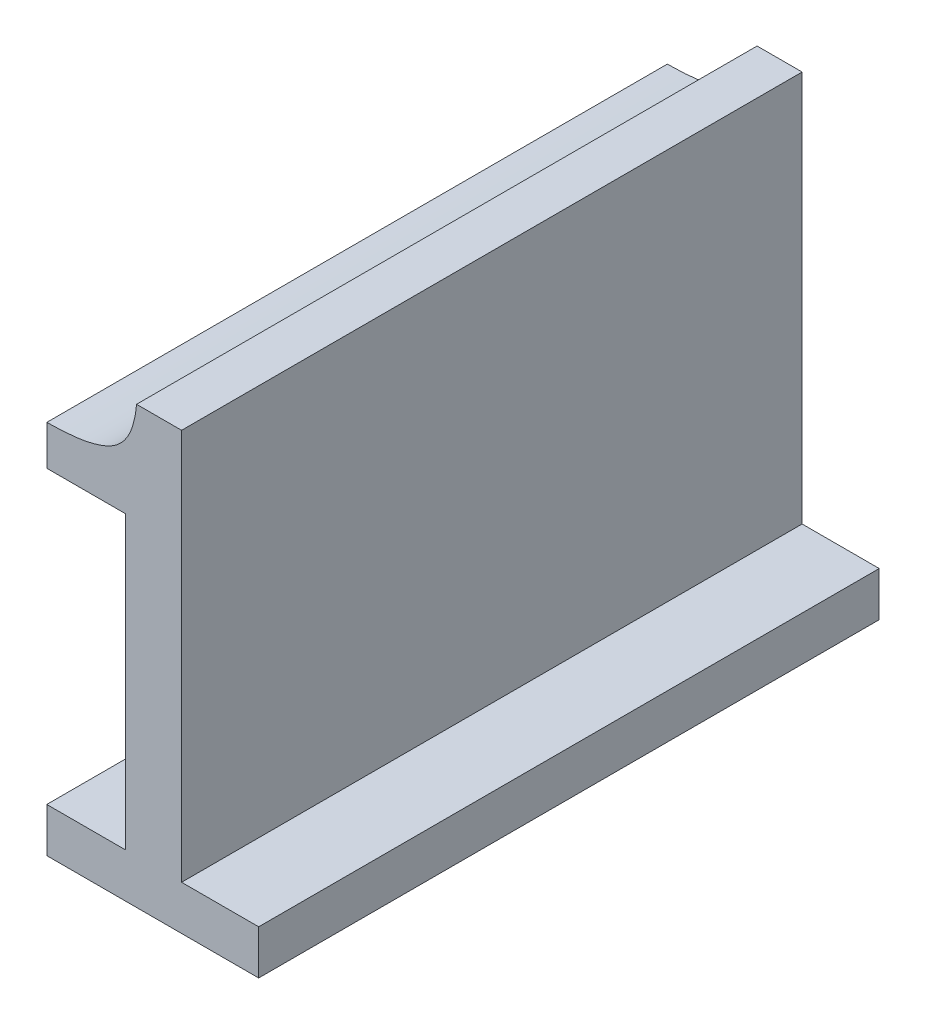
ISO-10303-21;
HEADER;
FILE_DESCRIPTION(('STEP AP214'),'2;1');
FILE_NAME('part.step','',(''),(''),'','','');
FILE_SCHEMA(('AUTOMOTIVE_DESIGN { 1 0 10303 214 1 1 1 1 }'));
ENDSEC;
DATA;
#1=APPLICATION_CONTEXT('core data for automotive mechanical design processes');
#2=APPLICATION_PROTOCOL_DEFINITION('international standard','automotive_design',2000,#1);
#3=PRODUCT_CONTEXT('',#1,'mechanical');
#4=PRODUCT('Part','Part','',(#3));
#5=PRODUCT_RELATED_PRODUCT_CATEGORY('part','',(#4));
#6=PRODUCT_DEFINITION_FORMATION('','',#4);
#7=PRODUCT_DEFINITION_CONTEXT('part definition',#1,'design');
#8=PRODUCT_DEFINITION('design','',#6,#7);
#9=PRODUCT_DEFINITION_SHAPE('','',#8);
#10=(LENGTH_UNIT() NAMED_UNIT(*) SI_UNIT(.MILLI.,.METRE.));
#11=(NAMED_UNIT(*) PLANE_ANGLE_UNIT() SI_UNIT($,.RADIAN.));
#12=(NAMED_UNIT(*) SI_UNIT($,.STERADIAN.) SOLID_ANGLE_UNIT());
#13=UNCERTAINTY_MEASURE_WITH_UNIT(LENGTH_MEASURE(1.E-05),#10,'distance_accuracy_value','');
#14=(GEOMETRIC_REPRESENTATION_CONTEXT(3) GLOBAL_UNCERTAINTY_ASSIGNED_CONTEXT((#13)) GLOBAL_UNIT_ASSIGNED_CONTEXT((#10,
#11,#12)) REPRESENTATION_CONTEXT('',''));
#15=CARTESIAN_POINT('',(0.,0.,0.));
#16=DIRECTION('',(0.,0.,1.));
#17=DIRECTION('',(1.,0.,0.));
#18=AXIS2_PLACEMENT_3D('',#15,#16,#17);
#19=CARTESIAN_POINT('',(0.788286562016744,-0.564767109594651,0.));
#20=DIRECTION('',(-1.,0.,0.));
#21=DIRECTION('',(0.,-1.,0.));
#22=AXIS2_PLACEMENT_3D('',#19,#20,#21);
#23=PLANE('',#22);
#24=DIRECTION('',(0.,1.,0.));
#25=VECTOR('',#24,1.);
#26=CARTESIAN_POINT('',(0.788286562016744,-0.571914597659679,0.));
#27=LINE('',#26,#25);
#28=CARTESIAN_POINT('',(0.788286562016744,-0.571914597659679,0.));
#29=VERTEX_POINT('',#28);
#30=CARTESIAN_POINT('',(0.788286562016744,-0.564767109594651,0.));
#31=VERTEX_POINT('',#30);
#32=EDGE_CURVE('E11',#29,#31,#27,.T.);
#33=ORIENTED_EDGE('',*,*,#32,.F.);
#34=DIRECTION('',(0.,0.,1.));
#35=VECTOR('',#34,1.);
#36=CARTESIAN_POINT('',(0.788286562016744,-0.571914597659679,0.));
#37=LINE('',#36,#35);
#38=CARTESIAN_POINT('',(0.788286562016744,-0.571914597659679,0.1));
#39=VERTEX_POINT('',#38);
#40=EDGE_CURVE('E374',#29,#39,#37,.T.);
#41=ORIENTED_EDGE('',*,*,#40,.T.);
#42=DIRECTION('',(0.,-1.,0.));
#43=VECTOR('',#42,1.);
#44=CARTESIAN_POINT('',(0.788286562016744,-0.564767109594651,0.1));
#45=LINE('',#44,#43);
#46=CARTESIAN_POINT('',(0.788286562016744,-0.564767109594651,0.1));
#47=VERTEX_POINT('',#46);
#48=EDGE_CURVE('E121',#47,#39,#45,.T.);
#49=ORIENTED_EDGE('',*,*,#48,.F.);
#50=DIRECTION('',(0.,0.,1.));
#51=VECTOR('',#50,1.);
#52=CARTESIAN_POINT('',(0.788286562016744,-0.564767109594651,0.));
#53=LINE('',#52,#51);
#54=EDGE_CURVE('E370',#31,#47,#53,.T.);
#55=ORIENTED_EDGE('',*,*,#54,.F.);
#56=EDGE_LOOP('',(#33,#41,#49,#55));
#57=FACE_BOUND('',#56,.T.);
#58=ADVANCED_FACE('F17',(#57),#23,.T.);
#59=CARTESIAN_POINT('',(0.800993207465682,-0.564767109594651,0.));
#60=DIRECTION('',(0.,1.,0.));
#61=DIRECTION('',(-1.,0.,0.));
#62=AXIS2_PLACEMENT_3D('',#59,#60,#61);
#63=PLANE('',#62);
#64=DIRECTION('',(1.,0.,0.));
#65=VECTOR('',#64,1.);
#66=CARTESIAN_POINT('',(0.788286562016744,-0.564767109594651,0.));
#67=LINE('',#66,#65);
#68=CARTESIAN_POINT('',(0.800993207465682,-0.564767109594651,0.));
#69=VERTEX_POINT('',#68);
#70=EDGE_CURVE('E24',#31,#69,#67,.T.);
#71=ORIENTED_EDGE('',*,*,#70,.F.);
#72=ORIENTED_EDGE('',*,*,#54,.T.);
#73=DIRECTION('',(-1.,0.,0.));
#74=VECTOR('',#73,1.);
#75=CARTESIAN_POINT('',(0.800993207465682,-0.564767109594651,0.1));
#76=LINE('',#75,#74);
#77=CARTESIAN_POINT('',(0.800993207465682,-0.564767109594651,0.1));
#78=VERTEX_POINT('',#77);
#79=EDGE_CURVE('E362',#78,#47,#76,.T.);
#80=ORIENTED_EDGE('',*,*,#79,.F.);
#81=DIRECTION('',(0.,0.,1.));
#82=VECTOR('',#81,1.);
#83=CARTESIAN_POINT('',(0.800993207465682,-0.564767109594651,0.));
#84=LINE('',#83,#82);
#85=EDGE_CURVE('E364',#69,#78,#84,.T.);
#86=ORIENTED_EDGE('',*,*,#85,.F.);
#87=EDGE_LOOP('',(#71,#72,#80,#86));
#88=FACE_BOUND('',#87,.T.);
#89=ADVANCED_FACE('F193',(#88),#63,.T.);
#90=CARTESIAN_POINT('',(0.800993207465682,-0.517854628405937,0.));
#91=DIRECTION('',(-1.,0.,0.));
#92=DIRECTION('',(0.,-1.,0.));
#93=AXIS2_PLACEMENT_3D('',#90,#91,#92);
#94=PLANE('',#93);
#95=DIRECTION('',(0.,1.,0.));
#96=VECTOR('',#95,1.);
#97=CARTESIAN_POINT('',(0.800993207465682,-0.564767109594651,0.));
#98=LINE('',#97,#96);
#99=CARTESIAN_POINT('',(0.800993207465682,-0.517854628405937,0.));
#100=VERTEX_POINT('',#99);
#101=EDGE_CURVE('E372',#69,#100,#98,.T.);
#102=ORIENTED_EDGE('',*,*,#101,.F.);
#103=ORIENTED_EDGE('',*,*,#85,.T.);
#104=DIRECTION('',(0.,-1.,0.));
#105=VECTOR('',#104,1.);
#106=CARTESIAN_POINT('',(0.800993207465682,-0.517854628405937,0.1));
#107=LINE('',#106,#105);
#108=CARTESIAN_POINT('',(0.800993207465682,-0.517854628405937,0.1));
#109=VERTEX_POINT('',#108);
#110=EDGE_CURVE('E182',#109,#78,#107,.T.);
#111=ORIENTED_EDGE('',*,*,#110,.F.);
#112=DIRECTION('',(0.,0.,1.));
#113=VECTOR('',#112,1.);
#114=CARTESIAN_POINT('',(0.800993207465682,-0.517854628405937,0.));
#115=LINE('',#114,#113);
#116=EDGE_CURVE('E355',#100,#109,#115,.T.);
#117=ORIENTED_EDGE('',*,*,#116,.F.);
#118=EDGE_LOOP('',(#102,#103,#111,#117));
#119=FACE_BOUND('',#118,.T.);
#120=ADVANCED_FACE('F191',(#119),#94,.T.);
#121=CARTESIAN_POINT('',(0.788286562016744,-0.517854628405937,0.));
#122=DIRECTION('',(0.,-1.,0.));
#123=DIRECTION('',(1.,0.,0.));
#124=AXIS2_PLACEMENT_3D('',#121,#122,#123);
#125=PLANE('',#124);
#126=DIRECTION('',(-1.,0.,0.));
#127=VECTOR('',#126,1.);
#128=CARTESIAN_POINT('',(0.800993207465682,-0.517854628405937,0.));
#129=LINE('',#128,#127);
#130=CARTESIAN_POINT('',(0.788286562016744,-0.517854628405937,0.));
#131=VERTEX_POINT('',#130);
#132=EDGE_CURVE('E361',#100,#131,#129,.T.);
#133=ORIENTED_EDGE('',*,*,#132,.F.);
#134=ORIENTED_EDGE('',*,*,#116,.T.);
#135=DIRECTION('',(1.,0.,0.));
#136=VECTOR('',#135,1.);
#137=CARTESIAN_POINT('',(0.788286562016744,-0.517854628405937,0.1));
#138=LINE('',#137,#136);
#139=CARTESIAN_POINT('',(0.788286562016744,-0.517854628405937,0.1));
#140=VERTEX_POINT('',#139);
#141=EDGE_CURVE('E344',#140,#109,#138,.T.);
#142=ORIENTED_EDGE('',*,*,#141,.F.);
#143=DIRECTION('',(0.,0.,1.));
#144=VECTOR('',#143,1.);
#145=CARTESIAN_POINT('',(0.788286562016744,-0.517854628405937,0.));
#146=LINE('',#145,#144);
#147=EDGE_CURVE('E183',#131,#140,#146,.T.);
#148=ORIENTED_EDGE('',*,*,#147,.F.);
#149=EDGE_LOOP('',(#133,#134,#142,#148));
#150=FACE_BOUND('',#149,.T.);
#151=ADVANCED_FACE('F200',(#150),#125,.T.);
#152=CARTESIAN_POINT('',(0.788286562016744,-0.511444579585714,0.));
#153=DIRECTION('',(-1.,0.,0.));
#154=DIRECTION('',(0.,-1.,0.));
#155=AXIS2_PLACEMENT_3D('',#152,#153,#154);
#156=PLANE('',#155);
#157=DIRECTION('',(0.,1.,0.));
#158=VECTOR('',#157,1.);
#159=CARTESIAN_POINT('',(0.788286562016744,-0.517854628405937,0.));
#160=LINE('',#159,#158);
#161=CARTESIAN_POINT('',(0.788286562016744,-0.511444579585714,0.));
#162=VERTEX_POINT('',#161);
#163=EDGE_CURVE('E352',#131,#162,#160,.T.);
#164=ORIENTED_EDGE('',*,*,#163,.F.);
#165=ORIENTED_EDGE('',*,*,#147,.T.);
#166=DIRECTION('',(0.,-1.,0.));
#167=VECTOR('',#166,1.);
#168=CARTESIAN_POINT('',(0.788286562016744,-0.511444579585714,0.1));
#169=LINE('',#168,#167);
#170=CARTESIAN_POINT('',(0.788286562016744,-0.511444579585714,0.1));
#171=VERTEX_POINT('',#170);
#172=EDGE_CURVE('E338',#171,#140,#169,.T.);
#173=ORIENTED_EDGE('',*,*,#172,.F.);
#174=DIRECTION('',(0.,0.,1.));
#175=VECTOR('',#174,1.);
#176=CARTESIAN_POINT('',(0.788286562016744,-0.511444579585714,0.));
#177=LINE('',#176,#175);
#178=EDGE_CURVE('E340',#162,#171,#177,.T.);
#179=ORIENTED_EDGE('',*,*,#178,.F.);
#180=EDGE_LOOP('',(#164,#165,#173,#179));
#181=FACE_BOUND('',#180,.T.);
#182=ADVANCED_FACE('F163',(#181),#156,.T.);
#183=CARTESIAN_POINT('',(0.802751716434062,-0.501687691115994,0.));
#184=CARTESIAN_POINT('',(0.802751716434062,-0.501687691115994,0.1));
#185=CARTESIAN_POINT('',(0.802297907668028,-0.507360300691412,0.));
#186=CARTESIAN_POINT('',(0.802297907668028,-0.507360300691412,0.1));
#187=CARTESIAN_POINT('',(0.795490776177526,-0.511444579585714,0.));
#188=CARTESIAN_POINT('',(0.795490776177526,-0.511444579585714,0.1));
#189=CARTESIAN_POINT('',(0.788286562016744,-0.511444579585714,0.));
#190=CARTESIAN_POINT('',(0.788286562016744,-0.511444579585714,0.1));
#191=B_SPLINE_SURFACE_WITH_KNOTS('',2,1,((#183,#184),(#185,#186),(#187,#188),(#189,#190)),
.UNSPECIFIED.,.F.,.F.,.F.,(3,1,3),(2,2),(0.,0.5,1.),(0.,1.),.UNSPECIFIED.);
#192=CARTESIAN_POINT('',(0.788286562016744,-0.511444579585714,0.));
#193=CARTESIAN_POINT('',(0.789341346345411,-0.511441344045223,0.));
#194=CARTESIAN_POINT('',(0.790397622506284,-0.511411754334125,0.));
#195=CARTESIAN_POINT('',(0.792524805528619,-0.511252086753534,0.));
#196=CARTESIAN_POINT('',(0.793595533626679,-0.511119845853318,0.));
#197=CARTESIAN_POINT('',(0.795850889361423,-0.510676745643417,0.));
#198=CARTESIAN_POINT('',(0.797032768771086,-0.510345386512734,0.));
#199=CARTESIAN_POINT('',(0.798800425009528,-0.509486844418183,0.));
#200=CARTESIAN_POINT('',(0.799439378659929,-0.509085787393632,0.));
#201=CARTESIAN_POINT('',(0.800507502337083,-0.508107342260813,0.));
#202=CARTESIAN_POINT('',(0.800945812999358,-0.507540146505306,0.));
#203=CARTESIAN_POINT('',(0.801723741044798,-0.506209141997117,0.));
#204=CARTESIAN_POINT('',(0.802030871404872,-0.505428337709547,0.));
#205=CARTESIAN_POINT('',(0.802521324633601,-0.503660867682538,0.));
#206=CARTESIAN_POINT('',(0.802669576336309,-0.502663451596321,0.));
#207=CARTESIAN_POINT('',(0.802751716653828,-0.501687688368919,0.));
#208=B_SPLINE_CURVE_WITH_KNOTS('',3,(#192,#193,#194,#195,#196,#197,#198,#199,#200,#201,#202,
#203,#204,#205,#206,#207),.UNSPECIFIED.,.F.,.F.,(4,2,2,2,2,2,2,4),(0.,0.00316523013740166,
0.00639902998805549,0.0100423677027386,0.0122699825872781,0.0143823883159503,0.0168793029607655,
0.0198553987244621),.UNSPECIFIED.);
#209=CARTESIAN_POINT('',(0.802751716434062,-0.501687691115994,0.));
#210=VERTEX_POINT('',#209);
#211=EDGE_CURVE('E173',#162,#210,#208,.T.);
#212=CARTESIAN_POINT('',(0.802751716434062,-0.501687691115994,0.1));
#213=CARTESIAN_POINT('',(0.802651171602445,-0.502918520319898,0.1));
#214=CARTESIAN_POINT('',(0.802432993721279,-0.504220926122383,0.1));
#215=CARTESIAN_POINT('',(0.80170053928,-0.506252745195735,0.1));
#216=CARTESIAN_POINT('',(0.801303946321314,-0.507031794416367,0.1));
#217=CARTESIAN_POINT('',(0.800342867120063,-0.508278479830506,0.1));
#218=CARTESIAN_POINT('',(0.799821904185121,-0.508776972568988,0.1));
#219=CARTESIAN_POINT('',(0.798638892003514,-0.509597280981284,0.1));
#220=CARTESIAN_POINT('',(0.797972918405804,-0.509913042352013,0.1));
#221=CARTESIAN_POINT('',(0.796341737058513,-0.51053362368397,0.1));
#222=CARTESIAN_POINT('',(0.795360258143453,-0.51078716618803,0.1));
#223=CARTESIAN_POINT('',(0.792356809653153,-0.511330193514212,0.1));
#224=CARTESIAN_POINT('',(0.790284567543637,-0.511397636466481,0.1));
#225=CARTESIAN_POINT('',(0.788286562016744,-0.511444579585714,0.1));
#226=B_SPLINE_CURVE_WITH_KNOTS('',3,(#212,#213,#214,#215,#216,#217,#218,#219,#220,#221,#222,
#223,#224,#225),.UNSPECIFIED.,.F.,.F.,(4,2,2,2,2,2,4),(0.,0.00381901267039192,
0.00641076835354874,0.00853223663564703,0.0107204735217173,0.0137534290530328,
0.0198477896058937),.UNSPECIFIED.);
#227=CARTESIAN_POINT('',(0.802751716434062,-0.501687691115994,0.1));
#228=VERTEX_POINT('',#227);
#229=EDGE_CURVE('E142',#228,#171,#226,.T.);
#230=DIRECTION('',(0.,0.,1.));
#231=VECTOR('',#230,1.);
#232=CARTESIAN_POINT('',(0.802751716434062,-0.501687691115994,0.));
#233=LINE('',#232,#231);
#234=EDGE_CURVE('E151',#210,#228,#233,.T.);
#235=ORIENTED_EDGE('',*,*,#211,.F.);
#236=ORIENTED_EDGE('',*,*,#178,.T.);
#237=ORIENTED_EDGE('',*,*,#229,.F.);
#238=ORIENTED_EDGE('',*,*,#234,.F.);
#239=EDGE_LOOP('',(#235,#236,#237,#238));
#240=FACE_BOUND('',#239,.T.);
#241=ADVANCED_FACE('F156',(#240),#191,.T.);
#242=CARTESIAN_POINT('',(0.810012656690598,-0.501687691115994,0.));
#243=DIRECTION('',(0.,1.,0.));
#244=DIRECTION('',(-1.,0.,0.));
#245=AXIS2_PLACEMENT_3D('',#242,#243,#244);
#246=PLANE('',#245);
#247=DIRECTION('',(1.,0.,0.));
#248=VECTOR('',#247,1.);
#249=CARTESIAN_POINT('',(0.802751716434062,-0.501687691115994,0.));
#250=LINE('',#249,#248);
#251=CARTESIAN_POINT('',(0.810012656690598,-0.501687691115994,0.));
#252=VERTEX_POINT('',#251);
#253=EDGE_CURVE('E337',#210,#252,#250,.T.);
#254=ORIENTED_EDGE('',*,*,#253,.F.);
#255=ORIENTED_EDGE('',*,*,#234,.T.);
#256=DIRECTION('',(-1.,0.,0.));
#257=VECTOR('',#256,1.);
#258=CARTESIAN_POINT('',(0.810012656690598,-0.501687691115994,0.1));
#259=LINE('',#258,#257);
#260=CARTESIAN_POINT('',(0.810012656690598,-0.501687691115994,0.1));
#261=VERTEX_POINT('',#260);
#262=EDGE_CURVE('E134',#261,#228,#259,.T.);
#263=ORIENTED_EDGE('',*,*,#262,.F.);
#264=DIRECTION('',(0.,0.,1.));
#265=VECTOR('',#264,1.);
#266=CARTESIAN_POINT('',(0.810012656690598,-0.501687691115994,0.));
#267=LINE('',#266,#265);
#268=EDGE_CURVE('E137',#252,#261,#267,.T.);
#269=ORIENTED_EDGE('',*,*,#268,.F.);
#270=EDGE_LOOP('',(#254,#255,#263,#269));
#271=FACE_BOUND('',#270,.T.);
#272=ADVANCED_FACE('F162',(#271),#246,.T.);
#273=CARTESIAN_POINT('',(0.810012656690598,-0.564767109594651,0.));
#274=DIRECTION('',(1.,0.,0.));
#275=DIRECTION('',(0.,1.,0.));
#276=AXIS2_PLACEMENT_3D('',#273,#274,#275);
#277=PLANE('',#276);
#278=DIRECTION('',(0.,-1.,0.));
#279=VECTOR('',#278,1.);
#280=CARTESIAN_POINT('',(0.810012656690598,-0.501687691115994,0.));
#281=LINE('',#280,#279);
#282=CARTESIAN_POINT('',(0.810012656690598,-0.564767109594651,0.));
#283=VERTEX_POINT('',#282);
#284=EDGE_CURVE('E334',#252,#283,#281,.T.);
#285=ORIENTED_EDGE('',*,*,#284,.F.);
#286=ORIENTED_EDGE('',*,*,#268,.T.);
#287=DIRECTION('',(0.,1.,0.));
#288=VECTOR('',#287,1.);
#289=CARTESIAN_POINT('',(0.810012656690598,-0.564767109594651,0.1));
#290=LINE('',#289,#288);
#291=CARTESIAN_POINT('',(0.810012656690598,-0.564767109594651,0.1));
#292=VERTEX_POINT('',#291);
#293=EDGE_CURVE('E127',#292,#261,#290,.T.);
#294=ORIENTED_EDGE('',*,*,#293,.F.);
#295=DIRECTION('',(0.,0.,1.));
#296=VECTOR('',#295,1.);
#297=CARTESIAN_POINT('',(0.810012656690598,-0.564767109594651,0.));
#298=LINE('',#297,#296);
#299=EDGE_CURVE('E130',#283,#292,#298,.T.);
#300=ORIENTED_EDGE('',*,*,#299,.F.);
#301=EDGE_LOOP('',(#285,#286,#294,#300));
#302=FACE_BOUND('',#301,.T.);
#303=ADVANCED_FACE('F256',(#302),#277,.T.);
#304=CARTESIAN_POINT('',(0.822435671660765,-0.564767109594651,0.));
#305=DIRECTION('',(0.,1.,0.));
#306=DIRECTION('',(-1.,0.,0.));
#307=AXIS2_PLACEMENT_3D('',#304,#305,#306);
#308=PLANE('',#307);
#309=DIRECTION('',(1.,0.,0.));
#310=VECTOR('',#309,1.);
#311=CARTESIAN_POINT('',(0.810012656690598,-0.564767109594651,0.));
#312=LINE('',#311,#310);
#313=CARTESIAN_POINT('',(0.822435671660765,-0.564767109594651,0.));
#314=VERTEX_POINT('',#313);
#315=EDGE_CURVE('E139',#283,#314,#312,.T.);
#316=ORIENTED_EDGE('',*,*,#315,.F.);
#317=ORIENTED_EDGE('',*,*,#299,.T.);
#318=DIRECTION('',(-1.,0.,0.));
#319=VECTOR('',#318,1.);
#320=CARTESIAN_POINT('',(0.822435671660765,-0.564767109594651,0.1));
#321=LINE('',#320,#319);
#322=CARTESIAN_POINT('',(0.822435671660765,-0.564767109594651,0.1));
#323=VERTEX_POINT('',#322);
#324=EDGE_CURVE('E107',#323,#292,#321,.T.);
#325=ORIENTED_EDGE('',*,*,#324,.F.);
#326=DIRECTION('',(0.,0.,1.));
#327=VECTOR('',#326,1.);
#328=CARTESIAN_POINT('',(0.822435671660765,-0.564767109594651,0.));
#329=LINE('',#328,#327);
#330=EDGE_CURVE('E113',#314,#323,#329,.T.);
#331=ORIENTED_EDGE('',*,*,#330,.F.);
#332=EDGE_LOOP('',(#316,#317,#325,#331));
#333=FACE_BOUND('',#332,.T.);
#334=ADVANCED_FACE('F266',(#333),#308,.T.);
#335=CARTESIAN_POINT('',(0.822435671660765,-0.571914597659679,0.));
#336=DIRECTION('',(1.,0.,0.));
#337=DIRECTION('',(0.,1.,0.));
#338=AXIS2_PLACEMENT_3D('',#335,#336,#337);
#339=PLANE('',#338);
#340=DIRECTION('',(0.,-1.,0.));
#341=VECTOR('',#340,1.);
#342=CARTESIAN_POINT('',(0.822435671660765,-0.564767109594651,0.));
#343=LINE('',#342,#341);
#344=CARTESIAN_POINT('',(0.822435671660765,-0.571914597659679,0.));
#345=VERTEX_POINT('',#344);
#346=EDGE_CURVE('E132',#314,#345,#343,.T.);
#347=ORIENTED_EDGE('',*,*,#346,.F.);
#348=ORIENTED_EDGE('',*,*,#330,.T.);
#349=DIRECTION('',(0.,1.,0.));
#350=VECTOR('',#349,1.);
#351=CARTESIAN_POINT('',(0.822435671660765,-0.571914597659679,0.1));
#352=LINE('',#351,#350);
#353=CARTESIAN_POINT('',(0.822435671660765,-0.571914597659679,0.1));
#354=VERTEX_POINT('',#353);
#355=EDGE_CURVE('E108',#354,#323,#352,.T.);
#356=ORIENTED_EDGE('',*,*,#355,.F.);
#357=DIRECTION('',(0.,0.,1.));
#358=VECTOR('',#357,1.);
#359=CARTESIAN_POINT('',(0.822435671660765,-0.571914597659679,0.));
#360=LINE('',#359,#358);
#361=EDGE_CURVE('E97',#345,#354,#360,.T.);
#362=ORIENTED_EDGE('',*,*,#361,.F.);
#363=EDGE_LOOP('',(#347,#348,#356,#362));
#364=FACE_BOUND('',#363,.T.);
#365=ADVANCED_FACE('F111',(#364),#339,.T.);
#366=CARTESIAN_POINT('',(0.788286562016744,-0.571914597659679,0.));
#367=DIRECTION('',(0.,-1.,0.));
#368=DIRECTION('',(1.,0.,0.));
#369=AXIS2_PLACEMENT_3D('',#366,#367,#368);
#370=PLANE('',#369);
#371=DIRECTION('',(-1.,0.,0.));
#372=VECTOR('',#371,1.);
#373=CARTESIAN_POINT('',(0.822435671660765,-0.571914597659679,0.));
#374=LINE('',#373,#372);
#375=EDGE_CURVE('E104',#345,#29,#374,.T.);
#376=ORIENTED_EDGE('',*,*,#375,.F.);
#377=ORIENTED_EDGE('',*,*,#361,.T.);
#378=DIRECTION('',(1.,0.,0.));
#379=VECTOR('',#378,1.);
#380=CARTESIAN_POINT('',(0.788286562016744,-0.571914597659679,0.1));
#381=LINE('',#380,#379);
#382=EDGE_CURVE('E102',#39,#354,#381,.T.);
#383=ORIENTED_EDGE('',*,*,#382,.F.);
#384=ORIENTED_EDGE('',*,*,#40,.F.);
#385=EDGE_LOOP('',(#376,#377,#383,#384));
#386=FACE_BOUND('',#385,.T.);
#387=ADVANCED_FACE('F99',(#386),#370,.T.);
#388=CARTESIAN_POINT('',(0.804146785374694,-0.542496223613711,0.));
#389=DIRECTION('',(0.,0.,1.));
#390=DIRECTION('',(1.,0.,0.));
#391=AXIS2_PLACEMENT_3D('',#388,#389,#390);
#392=PLANE('',#391);
#393=ORIENTED_EDGE('',*,*,#375,.T.);
#394=ORIENTED_EDGE('',*,*,#32,.T.);
#395=ORIENTED_EDGE('',*,*,#70,.T.);
#396=ORIENTED_EDGE('',*,*,#101,.T.);
#397=ORIENTED_EDGE('',*,*,#132,.T.);
#398=ORIENTED_EDGE('',*,*,#163,.T.);
#399=ORIENTED_EDGE('',*,*,#211,.T.);
#400=ORIENTED_EDGE('',*,*,#253,.T.);
#401=ORIENTED_EDGE('',*,*,#284,.T.);
#402=ORIENTED_EDGE('',*,*,#315,.T.);
#403=ORIENTED_EDGE('',*,*,#346,.T.);
#404=EDGE_LOOP('',(#393,#394,#395,#396,#397,#398,#399,#400,#401,#402,#403));
#405=FACE_BOUND('',#404,.T.);
#406=ADVANCED_FACE('F186',(#405),#392,.F.);
#407=CARTESIAN_POINT('',(0.804146785374694,-0.542496223613711,0.1));
#408=DIRECTION('',(0.,0.,1.));
#409=DIRECTION('',(1.,0.,0.));
#410=AXIS2_PLACEMENT_3D('',#407,#408,#409);
#411=PLANE('',#410);
#412=ORIENTED_EDGE('',*,*,#382,.T.);
#413=ORIENTED_EDGE('',*,*,#355,.T.);
#414=ORIENTED_EDGE('',*,*,#324,.T.);
#415=ORIENTED_EDGE('',*,*,#293,.T.);
#416=ORIENTED_EDGE('',*,*,#262,.T.);
#417=ORIENTED_EDGE('',*,*,#229,.T.);
#418=ORIENTED_EDGE('',*,*,#172,.T.);
#419=ORIENTED_EDGE('',*,*,#141,.T.);
#420=ORIENTED_EDGE('',*,*,#110,.T.);
#421=ORIENTED_EDGE('',*,*,#79,.T.);
#422=ORIENTED_EDGE('',*,*,#48,.T.);
#423=EDGE_LOOP('',(#412,#413,#414,#415,#416,#417,#418,#419,#420,#421,#422));
#424=FACE_BOUND('',#423,.T.);
#425=ADVANCED_FACE('F118',(#424),#411,.T.);
#426=CLOSED_SHELL('',(#58,#89,#120,#151,#182,#241,#272,#303,#334,#365,#387,#406,#425));
#427=MANIFOLD_SOLID_BREP('B1',#426);
#428=ADVANCED_BREP_SHAPE_REPRESENTATION('',(#18,#427),#14);
#429=SHAPE_DEFINITION_REPRESENTATION(#9,#428);
ENDSEC;
END-ISO-10303-21;
